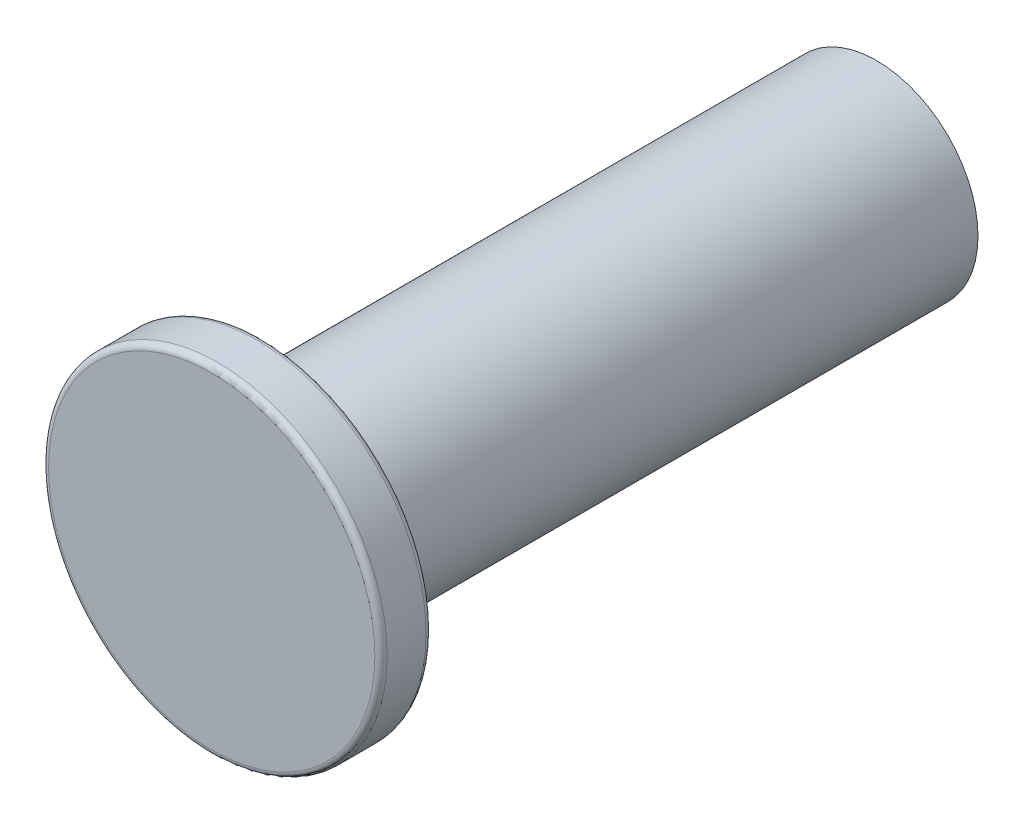
ISO-10303-21;
HEADER;
FILE_DESCRIPTION(('STEP AP214'),'2;1');
FILE_NAME('part.step','',(''),(''),'','','');
FILE_SCHEMA(('AUTOMOTIVE_DESIGN { 1 0 10303 214 1 1 1 1 }'));
ENDSEC;
DATA;
#1=APPLICATION_CONTEXT('core data for automotive mechanical design processes');
#2=APPLICATION_PROTOCOL_DEFINITION('international standard','automotive_design',2000,#1);
#3=PRODUCT_CONTEXT('',#1,'mechanical');
#4=PRODUCT('Part','Part','',(#3));
#5=PRODUCT_RELATED_PRODUCT_CATEGORY('part','',(#4));
#6=PRODUCT_DEFINITION_FORMATION('','',#4);
#7=PRODUCT_DEFINITION_CONTEXT('part definition',#1,'design');
#8=PRODUCT_DEFINITION('design','',#6,#7);
#9=PRODUCT_DEFINITION_SHAPE('','',#8);
#10=(LENGTH_UNIT() NAMED_UNIT(*) SI_UNIT(.MILLI.,.METRE.));
#11=(NAMED_UNIT(*) PLANE_ANGLE_UNIT() SI_UNIT($,.RADIAN.));
#12=(NAMED_UNIT(*) SI_UNIT($,.STERADIAN.) SOLID_ANGLE_UNIT());
#13=UNCERTAINTY_MEASURE_WITH_UNIT(LENGTH_MEASURE(1.E-05),#10,'distance_accuracy_value','');
#14=(GEOMETRIC_REPRESENTATION_CONTEXT(3) GLOBAL_UNCERTAINTY_ASSIGNED_CONTEXT((#13)) GLOBAL_UNIT_ASSIGNED_CONTEXT((#10,
#11,#12)) REPRESENTATION_CONTEXT('',''));
#15=CARTESIAN_POINT('',(0.,0.,0.));
#16=DIRECTION('',(0.,0.,1.));
#17=DIRECTION('',(1.,0.,0.));
#18=AXIS2_PLACEMENT_3D('',#15,#16,#17);
#19=CARTESIAN_POINT('',(0.,0.,-76.2));
#20=DIRECTION('',(0.,0.,1.));
#21=DIRECTION('',(1.,0.,0.));
#22=AXIS2_PLACEMENT_3D('',#19,#20,#21);
#23=CYLINDRICAL_SURFACE('',#22,12.573);
#24=CARTESIAN_POINT('',(0.,0.,-76.2));
#25=DIRECTION('',(0.,0.,1.));
#26=DIRECTION('',(1.,0.,0.));
#27=AXIS2_PLACEMENT_3D('',#24,#25,#26);
#28=CIRCLE('',#27,12.573);
#29=CARTESIAN_POINT('',(12.573,0.,-76.2));
#30=VERTEX_POINT('',#29);
#31=EDGE_CURVE('E50',#30,#30,#28,.T.);
#32=ORIENTED_EDGE('',*,*,#31,.T.);
#33=EDGE_LOOP('',(#32));
#34=FACE_BOUND('',#33,.T.);
#35=CARTESIAN_POINT('',(0.,0.,0.));
#36=DIRECTION('',(0.,0.,1.));
#37=DIRECTION('',(1.,0.,0.));
#38=AXIS2_PLACEMENT_3D('',#35,#36,#37);
#39=CIRCLE('',#38,12.573);
#40=CARTESIAN_POINT('',(12.573,0.,0.));
#41=VERTEX_POINT('',#40);
#42=EDGE_CURVE('E51',#41,#41,#39,.T.);
#43=ORIENTED_EDGE('',*,*,#42,.F.);
#44=EDGE_LOOP('',(#43));
#45=FACE_BOUND('',#44,.T.);
#46=ADVANCED_FACE('F30',(#34,#45),#23,.T.);
#47=CARTESIAN_POINT('',(0.,0.,-76.2));
#48=DIRECTION('',(0.,0.,1.));
#49=DIRECTION('',(1.,0.,0.));
#50=AXIS2_PLACEMENT_3D('',#47,#48,#49);
#51=PLANE('',#50);
#52=ORIENTED_EDGE('',*,*,#31,.F.);
#53=EDGE_LOOP('',(#52));
#54=FACE_BOUND('',#53,.T.);
#55=ADVANCED_FACE('F59',(#54),#51,.F.);
#56=CARTESIAN_POINT('',(0.,0.,6.35));
#57=DIRECTION('',(0.,0.,-1.));
#58=DIRECTION('',(-1.,0.,0.));
#59=AXIS2_PLACEMENT_3D('',#56,#57,#58);
#60=CYLINDRICAL_SURFACE('',#59,21.0185);
#61=CARTESIAN_POINT('',(0.,0.,5.588));
#62=DIRECTION('',(0.,0.,1.));
#63=DIRECTION('',(1.,0.,0.));
#64=AXIS2_PLACEMENT_3D('',#61,#62,#63);
#65=CIRCLE('',#64,21.0185);
#66=CARTESIAN_POINT('',(21.0185,0.,5.588));
#67=VERTEX_POINT('',#66);
#68=EDGE_CURVE('E37',#67,#67,#65,.F.);
#69=ORIENTED_EDGE('',*,*,#68,.T.);
#70=EDGE_LOOP('',(#69));
#71=FACE_BOUND('',#70,.T.);
#72=CARTESIAN_POINT('',(0.,0.,0.762));
#73=DIRECTION('',(0.,0.,1.));
#74=DIRECTION('',(1.,0.,0.));
#75=AXIS2_PLACEMENT_3D('',#72,#73,#74);
#76=CIRCLE('',#75,21.0185);
#77=CARTESIAN_POINT('',(21.0185,0.,0.762));
#78=VERTEX_POINT('',#77);
#79=EDGE_CURVE('E41',#78,#78,#76,.T.);
#80=ORIENTED_EDGE('',*,*,#79,.T.);
#81=EDGE_LOOP('',(#80));
#82=FACE_BOUND('',#81,.T.);
#83=ADVANCED_FACE('F61',(#71,#82),#60,.T.);
#84=CARTESIAN_POINT('',(0.,0.,6.35));
#85=DIRECTION('',(0.,0.,1.));
#86=DIRECTION('',(1.,0.,0.));
#87=AXIS2_PLACEMENT_3D('',#84,#85,#86);
#88=PLANE('',#87);
#89=CARTESIAN_POINT('',(0.,0.,6.35));
#90=DIRECTION('',(0.,0.,1.));
#91=DIRECTION('',(1.,0.,0.));
#92=AXIS2_PLACEMENT_3D('',#89,#90,#91);
#93=CIRCLE('',#92,20.2565);
#94=CARTESIAN_POINT('',(20.2565,0.,6.35));
#95=VERTEX_POINT('',#94);
#96=EDGE_CURVE('E45',#95,#95,#93,.T.);
#97=ORIENTED_EDGE('',*,*,#96,.T.);
#98=EDGE_LOOP('',(#97));
#99=FACE_BOUND('',#98,.T.);
#100=ADVANCED_FACE('F67',(#99),#88,.T.);
#101=CARTESIAN_POINT('',(0.,0.,0.));
#102=DIRECTION('',(0.,0.,1.));
#103=DIRECTION('',(1.,0.,0.));
#104=AXIS2_PLACEMENT_3D('',#101,#102,#103);
#105=PLANE('',#104);
#106=CARTESIAN_POINT('',(0.,0.,0.));
#107=DIRECTION('',(0.,0.,1.));
#108=DIRECTION('',(1.,0.,0.));
#109=AXIS2_PLACEMENT_3D('',#106,#107,#108);
#110=CIRCLE('',#109,20.2565);
#111=CARTESIAN_POINT('',(20.2565,0.,0.));
#112=VERTEX_POINT('',#111);
#113=EDGE_CURVE('E10',#112,#112,#110,.F.);
#114=ORIENTED_EDGE('',*,*,#113,.T.);
#115=EDGE_LOOP('',(#114));
#116=FACE_BOUND('',#115,.T.);
#117=ORIENTED_EDGE('',*,*,#42,.T.);
#118=EDGE_LOOP('',(#117));
#119=FACE_BOUND('',#118,.T.);
#120=ADVANCED_FACE('F73',(#116,#119),#105,.F.);
#121=CARTESIAN_POINT('',(0.,0.,5.588));
#122=DIRECTION('',(0.,0.,1.));
#123=DIRECTION('',(1.,0.,0.));
#124=AXIS2_PLACEMENT_3D('',#121,#122,#123);
#125=TOROIDAL_SURFACE('',#124,20.2565,0.762);
#126=ORIENTED_EDGE('',*,*,#68,.F.);
#127=EDGE_LOOP('',(#126));
#128=FACE_BOUND('',#127,.T.);
#129=ORIENTED_EDGE('',*,*,#96,.F.);
#130=EDGE_LOOP('',(#129));
#131=FACE_BOUND('',#130,.T.);
#132=ADVANCED_FACE('F71',(#128,#131),#125,.T.);
#133=CARTESIAN_POINT('',(0.,0.,0.762));
#134=DIRECTION('',(0.,0.,1.));
#135=DIRECTION('',(1.,0.,0.));
#136=AXIS2_PLACEMENT_3D('',#133,#134,#135);
#137=TOROIDAL_SURFACE('',#136,20.2565,0.762);
#138=ORIENTED_EDGE('',*,*,#113,.F.);
#139=EDGE_LOOP('',(#138));
#140=FACE_BOUND('',#139,.T.);
#141=ORIENTED_EDGE('',*,*,#79,.F.);
#142=EDGE_LOOP('',(#141));
#143=FACE_BOUND('',#142,.T.);
#144=ADVANCED_FACE('F32',(#140,#143),#137,.T.);
#145=CLOSED_SHELL('',(#46,#55,#83,#100,#120,#132,#144));
#146=MANIFOLD_SOLID_BREP('B2',#145);
#147=ADVANCED_BREP_SHAPE_REPRESENTATION('',(#18,#146),#14);
#148=SHAPE_DEFINITION_REPRESENTATION(#9,#147);
ENDSEC;
END-ISO-10303-21;
